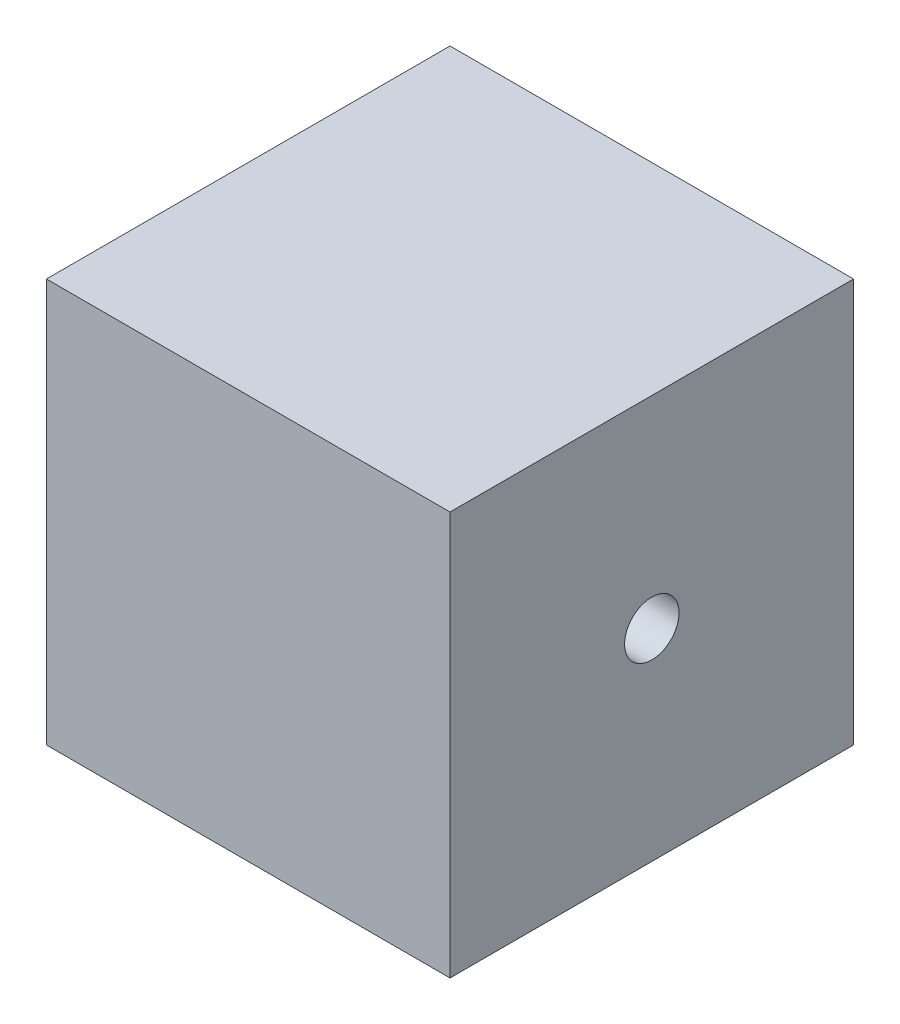
ISO-10303-21;
HEADER;
FILE_DESCRIPTION(('STEP AP214'),'2;1');
FILE_NAME('part.step','',(''),(''),'','','');
FILE_SCHEMA(('AUTOMOTIVE_DESIGN { 1 0 10303 214 1 1 1 1 }'));
ENDSEC;
DATA;
#1=APPLICATION_CONTEXT('core data for automotive mechanical design processes');
#2=APPLICATION_PROTOCOL_DEFINITION('international standard','automotive_design',2000,#1);
#3=PRODUCT_CONTEXT('',#1,'mechanical');
#4=PRODUCT('Part','Part','',(#3));
#5=PRODUCT_RELATED_PRODUCT_CATEGORY('part','',(#4));
#6=PRODUCT_DEFINITION_FORMATION('','',#4);
#7=PRODUCT_DEFINITION_CONTEXT('part definition',#1,'design');
#8=PRODUCT_DEFINITION('design','',#6,#7);
#9=PRODUCT_DEFINITION_SHAPE('','',#8);
#10=(LENGTH_UNIT() NAMED_UNIT(*) SI_UNIT(.MILLI.,.METRE.));
#11=(NAMED_UNIT(*) PLANE_ANGLE_UNIT() SI_UNIT($,.RADIAN.));
#12=(NAMED_UNIT(*) SI_UNIT($,.STERADIAN.) SOLID_ANGLE_UNIT());
#13=UNCERTAINTY_MEASURE_WITH_UNIT(LENGTH_MEASURE(1.E-05),#10,'distance_accuracy_value','');
#14=(GEOMETRIC_REPRESENTATION_CONTEXT(3) GLOBAL_UNCERTAINTY_ASSIGNED_CONTEXT((#13)) GLOBAL_UNIT_ASSIGNED_CONTEXT((#10,
#11,#12)) REPRESENTATION_CONTEXT('',''));
#15=CARTESIAN_POINT('',(0.,0.,0.));
#16=DIRECTION('',(0.,0.,1.));
#17=DIRECTION('',(1.,0.,0.));
#18=AXIS2_PLACEMENT_3D('',#15,#16,#17);
#19=CARTESIAN_POINT('',(10.,20.,-10.));
#20=DIRECTION('',(-1.,0.,0.));
#21=DIRECTION('',(0.,0.,1.));
#22=AXIS2_PLACEMENT_3D('',#19,#20,#21);
#23=PLANE('',#22);
#24=CARTESIAN_POINT('',(10.,10.,0.));
#25=DIRECTION('',(1.,0.,0.));
#26=DIRECTION('',(0.,0.,-1.));
#27=AXIS2_PLACEMENT_3D('',#24,#25,#26);
#28=CIRCLE('',#27,1.349385491796);
#29=CARTESIAN_POINT('',(10.,10.,-1.349385491796));
#30=VERTEX_POINT('',#29);
#31=EDGE_CURVE('E128',#30,#30,#28,.T.);
#32=ORIENTED_EDGE('',*,*,#31,.F.);
#33=EDGE_LOOP('',(#32));
#34=FACE_BOUND('',#33,.T.);
#35=DIRECTION('',(0.,0.,-1.));
#36=VECTOR('',#35,1.);
#37=CARTESIAN_POINT('',(10.,0.,-10.));
#38=LINE('',#37,#36);
#39=CARTESIAN_POINT('',(10.,0.,10.));
#40=VERTEX_POINT('',#39);
#41=CARTESIAN_POINT('',(10.,0.,-10.));
#42=VERTEX_POINT('',#41);
#43=EDGE_CURVE('E107',#40,#42,#38,.T.);
#44=ORIENTED_EDGE('',*,*,#43,.T.);
#45=DIRECTION('',(0.,-1.,0.));
#46=VECTOR('',#45,1.);
#47=CARTESIAN_POINT('',(10.,20.,-10.));
#48=LINE('',#47,#46);
#49=CARTESIAN_POINT('',(10.,20.,-10.));
#50=VERTEX_POINT('',#49);
#51=EDGE_CURVE('E11',#50,#42,#48,.T.);
#52=ORIENTED_EDGE('',*,*,#51,.F.);
#53=DIRECTION('',(0.,0.,-1.));
#54=VECTOR('',#53,1.);
#55=CARTESIAN_POINT('',(10.,20.,-10.));
#56=LINE('',#55,#54);
#57=CARTESIAN_POINT('',(10.,20.,10.));
#58=VERTEX_POINT('',#57);
#59=EDGE_CURVE('E91',#58,#50,#56,.T.);
#60=ORIENTED_EDGE('',*,*,#59,.F.);
#61=DIRECTION('',(0.,-1.,0.));
#62=VECTOR('',#61,1.);
#63=CARTESIAN_POINT('',(10.,20.,10.));
#64=LINE('',#63,#62);
#65=EDGE_CURVE('E103',#58,#40,#64,.T.);
#66=ORIENTED_EDGE('',*,*,#65,.T.);
#67=EDGE_LOOP('',(#44,#52,#60,#66));
#68=FACE_BOUND('',#67,.T.);
#69=ADVANCED_FACE('F39',(#34,#68),#23,.F.);
#70=CARTESIAN_POINT('',(-10.,20.,-10.));
#71=DIRECTION('',(0.,0.,1.));
#72=DIRECTION('',(1.,0.,0.));
#73=AXIS2_PLACEMENT_3D('',#70,#71,#72);
#74=PLANE('',#73);
#75=DIRECTION('',(-1.,0.,0.));
#76=VECTOR('',#75,1.);
#77=CARTESIAN_POINT('',(-10.,0.,-10.));
#78=LINE('',#77,#76);
#79=CARTESIAN_POINT('',(-10.,0.,-10.));
#80=VERTEX_POINT('',#79);
#81=EDGE_CURVE('E96',#42,#80,#78,.T.);
#82=ORIENTED_EDGE('',*,*,#81,.T.);
#83=DIRECTION('',(0.,-1.,0.));
#84=VECTOR('',#83,1.);
#85=CARTESIAN_POINT('',(-10.,20.,-10.));
#86=LINE('',#85,#84);
#87=CARTESIAN_POINT('',(-10.,20.,-10.));
#88=VERTEX_POINT('',#87);
#89=EDGE_CURVE('E48',#88,#80,#86,.T.);
#90=ORIENTED_EDGE('',*,*,#89,.F.);
#91=DIRECTION('',(-1.,0.,0.));
#92=VECTOR('',#91,1.);
#93=CARTESIAN_POINT('',(-10.,20.,-10.));
#94=LINE('',#93,#92);
#95=EDGE_CURVE('E86',#50,#88,#94,.T.);
#96=ORIENTED_EDGE('',*,*,#95,.F.);
#97=ORIENTED_EDGE('',*,*,#51,.T.);
#98=EDGE_LOOP('',(#82,#90,#96,#97));
#99=FACE_BOUND('',#98,.T.);
#100=ADVANCED_FACE('F95',(#99),#74,.F.);
#101=CARTESIAN_POINT('',(-10.,20.,-10.));
#102=DIRECTION('',(1.,0.,0.));
#103=DIRECTION('',(0.,0.,-1.));
#104=AXIS2_PLACEMENT_3D('',#101,#102,#103);
#105=PLANE('',#104);
#106=CARTESIAN_POINT('',(-10.,10.,0.));
#107=DIRECTION('',(1.,0.,0.));
#108=DIRECTION('',(0.,0.,-1.));
#109=AXIS2_PLACEMENT_3D('',#106,#107,#108);
#110=CIRCLE('',#109,1.349385491796);
#111=CARTESIAN_POINT('',(-10.,10.,-1.349385491796));
#112=VERTEX_POINT('',#111);
#113=EDGE_CURVE('E111',#112,#112,#110,.T.);
#114=ORIENTED_EDGE('',*,*,#113,.T.);
#115=EDGE_LOOP('',(#114));
#116=FACE_BOUND('',#115,.T.);
#117=DIRECTION('',(0.,0.,1.));
#118=VECTOR('',#117,1.);
#119=CARTESIAN_POINT('',(-10.,0.,-10.));
#120=LINE('',#119,#118);
#121=CARTESIAN_POINT('',(-10.,0.,10.));
#122=VERTEX_POINT('',#121);
#123=EDGE_CURVE('E73',#80,#122,#120,.T.);
#124=ORIENTED_EDGE('',*,*,#123,.T.);
#125=DIRECTION('',(0.,-1.,0.));
#126=VECTOR('',#125,1.);
#127=CARTESIAN_POINT('',(-10.,20.,10.));
#128=LINE('',#127,#126);
#129=CARTESIAN_POINT('',(-10.,20.,10.));
#130=VERTEX_POINT('',#129);
#131=EDGE_CURVE('E98',#130,#122,#128,.T.);
#132=ORIENTED_EDGE('',*,*,#131,.F.);
#133=DIRECTION('',(0.,0.,1.));
#134=VECTOR('',#133,1.);
#135=CARTESIAN_POINT('',(-10.,20.,-10.));
#136=LINE('',#135,#134);
#137=EDGE_CURVE('E89',#88,#130,#136,.T.);
#138=ORIENTED_EDGE('',*,*,#137,.F.);
#139=ORIENTED_EDGE('',*,*,#89,.T.);
#140=EDGE_LOOP('',(#124,#132,#138,#139));
#141=FACE_BOUND('',#140,.T.);
#142=ADVANCED_FACE('F99',(#116,#141),#105,.F.);
#143=CARTESIAN_POINT('',(-10.,20.,10.));
#144=DIRECTION('',(0.,0.,-1.));
#145=DIRECTION('',(-1.,0.,0.));
#146=AXIS2_PLACEMENT_3D('',#143,#144,#145);
#147=PLANE('',#146);
#148=DIRECTION('',(1.,0.,0.));
#149=VECTOR('',#148,1.);
#150=CARTESIAN_POINT('',(-10.,0.,10.));
#151=LINE('',#150,#149);
#152=EDGE_CURVE('E79',#122,#40,#151,.T.);
#153=ORIENTED_EDGE('',*,*,#152,.T.);
#154=ORIENTED_EDGE('',*,*,#65,.F.);
#155=DIRECTION('',(1.,0.,0.));
#156=VECTOR('',#155,1.);
#157=CARTESIAN_POINT('',(-10.,20.,10.));
#158=LINE('',#157,#156);
#159=EDGE_CURVE('E56',#130,#58,#158,.T.);
#160=ORIENTED_EDGE('',*,*,#159,.F.);
#161=ORIENTED_EDGE('',*,*,#131,.T.);
#162=EDGE_LOOP('',(#153,#154,#160,#161));
#163=FACE_BOUND('',#162,.T.);
#164=ADVANCED_FACE('F121',(#163),#147,.F.);
#165=CARTESIAN_POINT('',(0.,20.,0.));
#166=DIRECTION('',(0.,1.,0.));
#167=DIRECTION('',(0.,0.,1.));
#168=AXIS2_PLACEMENT_3D('',#165,#166,#167);
#169=PLANE('',#168);
#170=ORIENTED_EDGE('',*,*,#59,.T.);
#171=ORIENTED_EDGE('',*,*,#95,.T.);
#172=ORIENTED_EDGE('',*,*,#137,.T.);
#173=ORIENTED_EDGE('',*,*,#159,.T.);
#174=EDGE_LOOP('',(#170,#171,#172,#173));
#175=FACE_BOUND('',#174,.T.);
#176=ADVANCED_FACE('F87',(#175),#169,.T.);
#177=CARTESIAN_POINT('',(0.,0.,0.));
#178=DIRECTION('',(0.,1.,0.));
#179=DIRECTION('',(0.,0.,1.));
#180=AXIS2_PLACEMENT_3D('',#177,#178,#179);
#181=PLANE('',#180);
#182=ORIENTED_EDGE('',*,*,#43,.F.);
#183=ORIENTED_EDGE('',*,*,#152,.F.);
#184=ORIENTED_EDGE('',*,*,#123,.F.);
#185=ORIENTED_EDGE('',*,*,#81,.F.);
#186=EDGE_LOOP('',(#182,#183,#184,#185));
#187=FACE_BOUND('',#186,.T.);
#188=ADVANCED_FACE('F124',(#187),#181,.F.);
#189=CARTESIAN_POINT('',(-10.,10.,0.));
#190=DIRECTION('',(1.,0.,0.));
#191=DIRECTION('',(0.,0.,-1.));
#192=AXIS2_PLACEMENT_3D('',#189,#190,#191);
#193=CYLINDRICAL_SURFACE('',#192,1.349385491796);
#194=ORIENTED_EDGE('',*,*,#113,.F.);
#195=EDGE_LOOP('',(#194));
#196=FACE_BOUND('',#195,.T.);
#197=ORIENTED_EDGE('',*,*,#31,.T.);
#198=EDGE_LOOP('',(#197));
#199=FACE_BOUND('',#198,.T.);
#200=ADVANCED_FACE('F137',(#196,#199),#193,.F.);
#201=CLOSED_SHELL('',(#69,#100,#142,#164,#176,#188,#200));
#202=MANIFOLD_SOLID_BREP('B2',#201);
#203=ADVANCED_BREP_SHAPE_REPRESENTATION('',(#18,#202),#14);
#204=SHAPE_DEFINITION_REPRESENTATION(#9,#203);
ENDSEC;
END-ISO-10303-21;
